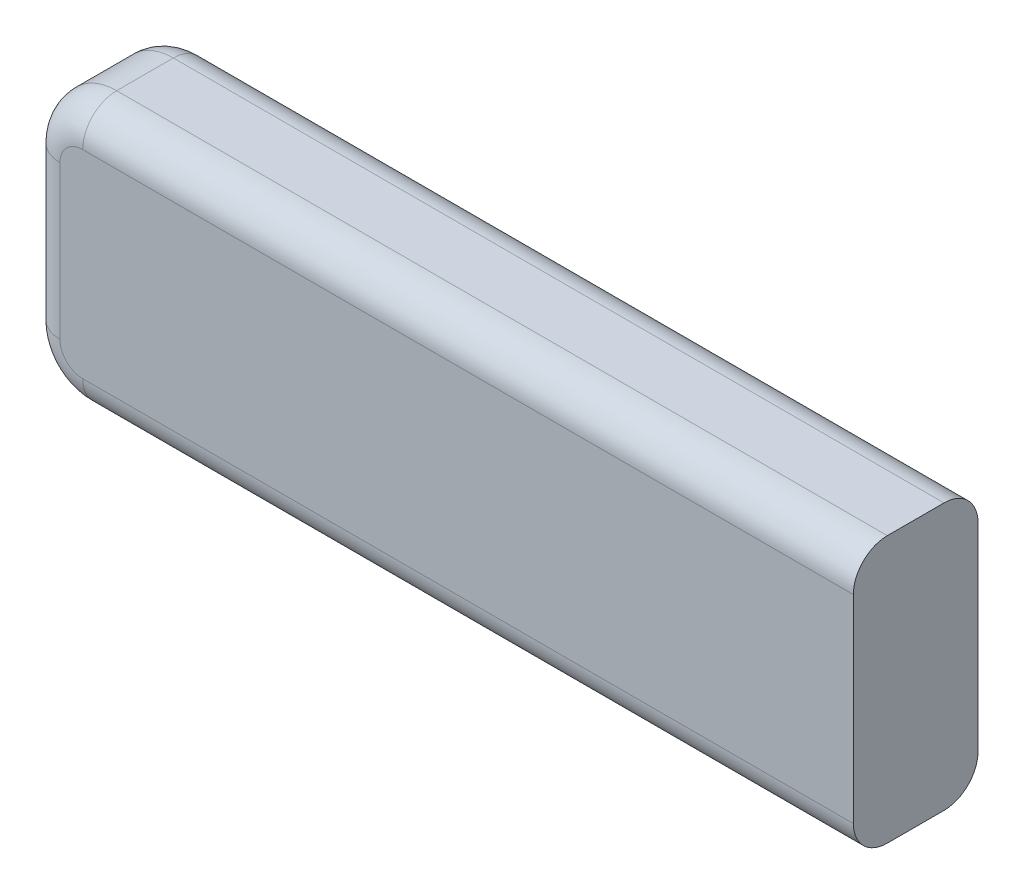
ISO-10303-21;
HEADER;
FILE_DESCRIPTION(('STEP AP214'),'2;1');
FILE_NAME('part.step','',(''),(''),'','','');
FILE_SCHEMA(('AUTOMOTIVE_DESIGN { 1 0 10303 214 1 1 1 1 }'));
ENDSEC;
DATA;
#1=APPLICATION_CONTEXT('core data for automotive mechanical design processes');
#2=APPLICATION_PROTOCOL_DEFINITION('international standard','automotive_design',2000,#1);
#3=PRODUCT_CONTEXT('',#1,'mechanical');
#4=PRODUCT('Part','Part','',(#3));
#5=PRODUCT_RELATED_PRODUCT_CATEGORY('part','',(#4));
#6=PRODUCT_DEFINITION_FORMATION('','',#4);
#7=PRODUCT_DEFINITION_CONTEXT('part definition',#1,'design');
#8=PRODUCT_DEFINITION('design','',#6,#7);
#9=PRODUCT_DEFINITION_SHAPE('','',#8);
#10=(LENGTH_UNIT() NAMED_UNIT(*) SI_UNIT(.MILLI.,.METRE.));
#11=(NAMED_UNIT(*) PLANE_ANGLE_UNIT() SI_UNIT($,.RADIAN.));
#12=(NAMED_UNIT(*) SI_UNIT($,.STERADIAN.) SOLID_ANGLE_UNIT());
#13=UNCERTAINTY_MEASURE_WITH_UNIT(LENGTH_MEASURE(1.E-05),#10,'distance_accuracy_value','');
#14=(GEOMETRIC_REPRESENTATION_CONTEXT(3) GLOBAL_UNCERTAINTY_ASSIGNED_CONTEXT((#13)) GLOBAL_UNIT_ASSIGNED_CONTEXT((#10,
#11,#12)) REPRESENTATION_CONTEXT('',''));
#15=CARTESIAN_POINT('',(0.,0.,0.));
#16=DIRECTION('',(0.,0.,1.));
#17=DIRECTION('',(1.,0.,0.));
#18=AXIS2_PLACEMENT_3D('',#15,#16,#17);
#19=CARTESIAN_POINT('',(0.,0.,5.5));
#20=DIRECTION('',(0.,0.,-1.));
#21=DIRECTION('',(-1.,0.,0.));
#22=AXIS2_PLACEMENT_3D('',#19,#20,#21);
#23=PLANE('',#22);
#24=CARTESIAN_POINT('',(2.5,2.5,5.5));
#25=DIRECTION('',(0.,0.,-1.));
#26=DIRECTION('',(-1.,0.,0.));
#27=AXIS2_PLACEMENT_3D('',#24,#25,#26);
#28=CIRCLE('',#27,1.);
#29=CARTESIAN_POINT('',(2.5,1.5,5.5));
#30=VERTEX_POINT('',#29);
#31=CARTESIAN_POINT('',(1.5,2.5,5.5));
#32=VERTEX_POINT('',#31);
#33=EDGE_CURVE('E200',#30,#32,#28,.T.);
#34=ORIENTED_EDGE('',*,*,#33,.F.);
#35=DIRECTION('',(1.,0.,0.));
#36=VECTOR('',#35,1.);
#37=CARTESIAN_POINT('',(0.,1.5,5.5));
#38=LINE('',#37,#36);
#39=CARTESIAN_POINT('',(36.5,1.5,5.5));
#40=VERTEX_POINT('',#39);
#41=EDGE_CURVE('E173',#30,#40,#38,.T.);
#42=ORIENTED_EDGE('',*,*,#41,.T.);
#43=DIRECTION('',(0.,1.,0.));
#44=VECTOR('',#43,1.);
#45=CARTESIAN_POINT('',(36.5,0.,5.5));
#46=LINE('',#45,#44);
#47=CARTESIAN_POINT('',(36.5,10.25,5.5));
#48=VERTEX_POINT('',#47);
#49=EDGE_CURVE('E137',#40,#48,#46,.T.);
#50=ORIENTED_EDGE('',*,*,#49,.T.);
#51=DIRECTION('',(-1.,0.,0.));
#52=VECTOR('',#51,1.);
#53=CARTESIAN_POINT('',(0.,10.25,5.5));
#54=LINE('',#53,#52);
#55=CARTESIAN_POINT('',(2.5,10.25,5.5));
#56=VERTEX_POINT('',#55);
#57=EDGE_CURVE('E167',#48,#56,#54,.T.);
#58=ORIENTED_EDGE('',*,*,#57,.T.);
#59=CARTESIAN_POINT('',(2.5,9.25,5.5));
#60=DIRECTION('',(0.,0.,-1.));
#61=DIRECTION('',(-1.,0.,0.));
#62=AXIS2_PLACEMENT_3D('',#59,#60,#61);
#63=CIRCLE('',#62,1.);
#64=CARTESIAN_POINT('',(1.5,9.25,5.5));
#65=VERTEX_POINT('',#64);
#66=EDGE_CURVE('E197',#65,#56,#63,.T.);
#67=ORIENTED_EDGE('',*,*,#66,.F.);
#68=DIRECTION('',(0.,-1.,0.));
#69=VECTOR('',#68,1.);
#70=CARTESIAN_POINT('',(1.5,0.,5.5));
#71=LINE('',#70,#69);
#72=EDGE_CURVE('E170',#65,#32,#71,.T.);
#73=ORIENTED_EDGE('',*,*,#72,.T.);
#74=EDGE_LOOP('',(#34,#42,#50,#58,#67,#73));
#75=FACE_BOUND('',#74,.T.);
#76=ADVANCED_FACE('F38',(#75),#23,.F.);
#77=CARTESIAN_POINT('',(0.,0.,0.));
#78=DIRECTION('',(0.,0.,-1.));
#79=DIRECTION('',(-1.,0.,0.));
#80=AXIS2_PLACEMENT_3D('',#77,#78,#79);
#81=PLANE('',#80);
#82=CARTESIAN_POINT('',(2.5,2.5,0.));
#83=DIRECTION('',(0.,0.,-1.));
#84=DIRECTION('',(-1.,0.,0.));
#85=AXIS2_PLACEMENT_3D('',#82,#83,#84);
#86=CIRCLE('',#85,1.);
#87=CARTESIAN_POINT('',(1.5,2.5,0.));
#88=VERTEX_POINT('',#87);
#89=CARTESIAN_POINT('',(2.5,1.5,0.));
#90=VERTEX_POINT('',#89);
#91=EDGE_CURVE('E188',#88,#90,#86,.F.);
#92=ORIENTED_EDGE('',*,*,#91,.F.);
#93=DIRECTION('',(0.,-1.,0.));
#94=VECTOR('',#93,1.);
#95=CARTESIAN_POINT('',(1.5,11.75,0.));
#96=LINE('',#95,#94);
#97=CARTESIAN_POINT('',(1.5,9.25,0.));
#98=VERTEX_POINT('',#97);
#99=EDGE_CURVE('E161',#88,#98,#96,.F.);
#100=ORIENTED_EDGE('',*,*,#99,.T.);
#101=CARTESIAN_POINT('',(2.5,9.25,0.));
#102=DIRECTION('',(0.,0.,-1.));
#103=DIRECTION('',(-1.,0.,0.));
#104=AXIS2_PLACEMENT_3D('',#101,#102,#103);
#105=CIRCLE('',#104,1.);
#106=CARTESIAN_POINT('',(2.5,10.25,0.));
#107=VERTEX_POINT('',#106);
#108=EDGE_CURVE('E185',#107,#98,#105,.F.);
#109=ORIENTED_EDGE('',*,*,#108,.F.);
#110=DIRECTION('',(-1.,0.,0.));
#111=VECTOR('',#110,1.);
#112=CARTESIAN_POINT('',(36.5,10.25,0.));
#113=LINE('',#112,#111);
#114=CARTESIAN_POINT('',(36.5,10.25,0.));
#115=VERTEX_POINT('',#114);
#116=EDGE_CURVE('E159',#107,#115,#113,.F.);
#117=ORIENTED_EDGE('',*,*,#116,.T.);
#118=DIRECTION('',(0.,1.,0.));
#119=VECTOR('',#118,1.);
#120=CARTESIAN_POINT('',(36.5,0.,0.));
#121=LINE('',#120,#119);
#122=CARTESIAN_POINT('',(36.5,1.5,0.));
#123=VERTEX_POINT('',#122);
#124=EDGE_CURVE('E221',#123,#115,#121,.T.);
#125=ORIENTED_EDGE('',*,*,#124,.F.);
#126=DIRECTION('',(1.,0.,0.));
#127=VECTOR('',#126,1.);
#128=CARTESIAN_POINT('',(0.,1.5,0.));
#129=LINE('',#128,#127);
#130=EDGE_CURVE('E164',#123,#90,#129,.F.);
#131=ORIENTED_EDGE('',*,*,#130,.T.);
#132=EDGE_LOOP('',(#92,#100,#109,#117,#125,#131));
#133=FACE_BOUND('',#132,.T.);
#134=ADVANCED_FACE('F266',(#133),#81,.T.);
#135=CARTESIAN_POINT('',(0.,0.,5.5));
#136=DIRECTION('',(1.,0.,0.));
#137=DIRECTION('',(0.,0.,-1.));
#138=AXIS2_PLACEMENT_3D('',#135,#136,#137);
#139=PLANE('',#138);
#140=DIRECTION('',(0.,-1.,0.));
#141=VECTOR('',#140,1.);
#142=CARTESIAN_POINT('',(0.,0.,4.));
#143=LINE('',#142,#141);
#144=CARTESIAN_POINT('',(0.,2.5,4.));
#145=VERTEX_POINT('',#144);
#146=CARTESIAN_POINT('',(0.,9.25,4.));
#147=VERTEX_POINT('',#146);
#148=EDGE_CURVE('E175',#145,#147,#143,.F.);
#149=ORIENTED_EDGE('',*,*,#148,.T.);
#150=DIRECTION('',(0.,0.,-1.));
#151=VECTOR('',#150,1.);
#152=CARTESIAN_POINT('',(0.,9.25,5.5));
#153=LINE('',#152,#151);
#154=CARTESIAN_POINT('',(0.,9.25,1.5));
#155=VERTEX_POINT('',#154);
#156=EDGE_CURVE('E213',#147,#155,#153,.T.);
#157=ORIENTED_EDGE('',*,*,#156,.T.);
#158=DIRECTION('',(0.,-1.,0.));
#159=VECTOR('',#158,1.);
#160=CARTESIAN_POINT('',(0.,0.,1.5));
#161=LINE('',#160,#159);
#162=CARTESIAN_POINT('',(0.,2.5,1.5));
#163=VERTEX_POINT('',#162);
#164=EDGE_CURVE('E178',#155,#163,#161,.T.);
#165=ORIENTED_EDGE('',*,*,#164,.T.);
#166=DIRECTION('',(0.,0.,-1.));
#167=VECTOR('',#166,1.);
#168=CARTESIAN_POINT('',(0.,2.5,5.5));
#169=LINE('',#168,#167);
#170=EDGE_CURVE('E211',#163,#145,#169,.F.);
#171=ORIENTED_EDGE('',*,*,#170,.T.);
#172=EDGE_LOOP('',(#149,#157,#165,#171));
#173=FACE_BOUND('',#172,.T.);
#174=ADVANCED_FACE('F271',(#173),#139,.F.);
#175=CARTESIAN_POINT('',(0.,0.,5.5));
#176=DIRECTION('',(0.,1.,0.));
#177=DIRECTION('',(0.,0.,1.));
#178=AXIS2_PLACEMENT_3D('',#175,#176,#177);
#179=PLANE('',#178);
#180=DIRECTION('',(1.,0.,0.));
#181=VECTOR('',#180,1.);
#182=CARTESIAN_POINT('',(0.,0.,4.));
#183=LINE('',#182,#181);
#184=CARTESIAN_POINT('',(36.5,0.,4.));
#185=VERTEX_POINT('',#184);
#186=CARTESIAN_POINT('',(2.5,0.,4.));
#187=VERTEX_POINT('',#186);
#188=EDGE_CURVE('E143',#185,#187,#183,.F.);
#189=ORIENTED_EDGE('',*,*,#188,.T.);
#190=DIRECTION('',(0.,0.,-1.));
#191=VECTOR('',#190,1.);
#192=CARTESIAN_POINT('',(2.5,0.,5.5));
#193=LINE('',#192,#191);
#194=CARTESIAN_POINT('',(2.5,0.,1.5));
#195=VERTEX_POINT('',#194);
#196=EDGE_CURVE('E11',#187,#195,#193,.T.);
#197=ORIENTED_EDGE('',*,*,#196,.T.);
#198=DIRECTION('',(1.,0.,0.));
#199=VECTOR('',#198,1.);
#200=CARTESIAN_POINT('',(36.5,0.,1.5));
#201=LINE('',#200,#199);
#202=CARTESIAN_POINT('',(36.5,0.,1.5));
#203=VERTEX_POINT('',#202);
#204=EDGE_CURVE('E146',#195,#203,#201,.T.);
#205=ORIENTED_EDGE('',*,*,#204,.T.);
#206=DIRECTION('',(0.,0.,-1.));
#207=VECTOR('',#206,1.);
#208=CARTESIAN_POINT('',(36.5,0.,5.5));
#209=LINE('',#208,#207);
#210=EDGE_CURVE('E135',#185,#203,#209,.T.);
#211=ORIENTED_EDGE('',*,*,#210,.F.);
#212=EDGE_LOOP('',(#189,#197,#205,#211));
#213=FACE_BOUND('',#212,.T.);
#214=ADVANCED_FACE('F142',(#213),#179,.F.);
#215=CARTESIAN_POINT('',(36.5,0.,5.5));
#216=DIRECTION('',(-1.,0.,0.));
#217=DIRECTION('',(0.,0.,1.));
#218=AXIS2_PLACEMENT_3D('',#215,#216,#217);
#219=PLANE('',#218);
#220=ORIENTED_EDGE('',*,*,#210,.T.);
#221=CARTESIAN_POINT('',(36.5,1.5,1.5));
#222=DIRECTION('',(-1.,0.,0.));
#223=DIRECTION('',(0.,0.,1.));
#224=AXIS2_PLACEMENT_3D('',#221,#222,#223);
#225=CIRCLE('',#224,1.5);
#226=EDGE_CURVE('E138',#203,#123,#225,.F.);
#227=ORIENTED_EDGE('',*,*,#226,.T.);
#228=ORIENTED_EDGE('',*,*,#124,.T.);
#229=CARTESIAN_POINT('',(36.5,10.25,1.5));
#230=DIRECTION('',(-1.,0.,0.));
#231=DIRECTION('',(0.,0.,1.));
#232=AXIS2_PLACEMENT_3D('',#229,#230,#231);
#233=CIRCLE('',#232,1.5);
#234=CARTESIAN_POINT('',(36.5,11.75,1.5));
#235=VERTEX_POINT('',#234);
#236=EDGE_CURVE('E139',#115,#235,#233,.F.);
#237=ORIENTED_EDGE('',*,*,#236,.T.);
#238=DIRECTION('',(0.,0.,-1.));
#239=VECTOR('',#238,1.);
#240=CARTESIAN_POINT('',(36.5,11.75,5.5));
#241=LINE('',#240,#239);
#242=CARTESIAN_POINT('',(36.5,11.75,4.));
#243=VERTEX_POINT('',#242);
#244=EDGE_CURVE('E148',#243,#235,#241,.T.);
#245=ORIENTED_EDGE('',*,*,#244,.F.);
#246=CARTESIAN_POINT('',(36.5,10.25,4.));
#247=DIRECTION('',(-1.,0.,0.));
#248=DIRECTION('',(0.,0.,1.));
#249=AXIS2_PLACEMENT_3D('',#246,#247,#248);
#250=CIRCLE('',#249,1.5);
#251=EDGE_CURVE('E152',#243,#48,#250,.F.);
#252=ORIENTED_EDGE('',*,*,#251,.T.);
#253=ORIENTED_EDGE('',*,*,#49,.F.);
#254=CARTESIAN_POINT('',(36.5,1.5,4.));
#255=DIRECTION('',(-1.,0.,0.));
#256=DIRECTION('',(0.,0.,1.));
#257=AXIS2_PLACEMENT_3D('',#254,#255,#256);
#258=CIRCLE('',#257,1.5);
#259=EDGE_CURVE('E132',#40,#185,#258,.F.);
#260=ORIENTED_EDGE('',*,*,#259,.T.);
#261=EDGE_LOOP('',(#220,#227,#228,#237,#245,#252,#253,#260));
#262=FACE_BOUND('',#261,.T.);
#263=ADVANCED_FACE('F134',(#262),#219,.F.);
#264=CARTESIAN_POINT('',(0.,11.75,5.5));
#265=DIRECTION('',(0.,-1.,0.));
#266=DIRECTION('',(0.,0.,-1.));
#267=AXIS2_PLACEMENT_3D('',#264,#265,#266);
#268=PLANE('',#267);
#269=DIRECTION('',(-1.,0.,0.));
#270=VECTOR('',#269,1.);
#271=CARTESIAN_POINT('',(0.,11.75,1.5));
#272=LINE('',#271,#270);
#273=CARTESIAN_POINT('',(2.5,11.75,1.5));
#274=VERTEX_POINT('',#273);
#275=EDGE_CURVE('E183',#235,#274,#272,.T.);
#276=ORIENTED_EDGE('',*,*,#275,.T.);
#277=DIRECTION('',(0.,0.,-1.));
#278=VECTOR('',#277,1.);
#279=CARTESIAN_POINT('',(2.5,11.75,5.5));
#280=LINE('',#279,#278);
#281=CARTESIAN_POINT('',(2.5,11.75,4.));
#282=VERTEX_POINT('',#281);
#283=EDGE_CURVE('E47',#274,#282,#280,.F.);
#284=ORIENTED_EDGE('',*,*,#283,.T.);
#285=DIRECTION('',(-1.,0.,0.));
#286=VECTOR('',#285,1.);
#287=CARTESIAN_POINT('',(0.,11.75,4.));
#288=LINE('',#287,#286);
#289=EDGE_CURVE('E181',#282,#243,#288,.F.);
#290=ORIENTED_EDGE('',*,*,#289,.T.);
#291=ORIENTED_EDGE('',*,*,#244,.T.);
#292=EDGE_LOOP('',(#276,#284,#290,#291));
#293=FACE_BOUND('',#292,.T.);
#294=ADVANCED_FACE('F254',(#293),#268,.F.);
#295=CARTESIAN_POINT('',(0.,10.25,1.5));
#296=DIRECTION('',(1.,0.,0.));
#297=DIRECTION('',(0.,0.,-1.));
#298=AXIS2_PLACEMENT_3D('',#295,#296,#297);
#299=CYLINDRICAL_SURFACE('',#298,1.5);
#300=ORIENTED_EDGE('',*,*,#116,.F.);
#301=CARTESIAN_POINT('',(2.5,10.25,1.5));
#302=DIRECTION('',(1.,0.,0.));
#303=DIRECTION('',(0.,0.,-1.));
#304=AXIS2_PLACEMENT_3D('',#301,#302,#303);
#305=CIRCLE('',#304,1.5);
#306=EDGE_CURVE('E63',#107,#274,#305,.T.);
#307=ORIENTED_EDGE('',*,*,#306,.T.);
#308=ORIENTED_EDGE('',*,*,#275,.F.);
#309=ORIENTED_EDGE('',*,*,#236,.F.);
#310=EDGE_LOOP('',(#300,#307,#308,#309));
#311=FACE_BOUND('',#310,.T.);
#312=ADVANCED_FACE('F252',(#311),#299,.T.);
#313=CARTESIAN_POINT('',(1.5,0.,1.5));
#314=DIRECTION('',(0.,1.,0.));
#315=DIRECTION('',(0.,0.,1.));
#316=AXIS2_PLACEMENT_3D('',#313,#314,#315);
#317=CYLINDRICAL_SURFACE('',#316,1.5);
#318=ORIENTED_EDGE('',*,*,#164,.F.);
#319=CARTESIAN_POINT('',(1.5,9.25,1.5));
#320=DIRECTION('',(0.,-1.,0.));
#321=DIRECTION('',(0.,0.,-1.));
#322=AXIS2_PLACEMENT_3D('',#319,#320,#321);
#323=CIRCLE('',#322,1.5);
#324=EDGE_CURVE('E205',#155,#98,#323,.T.);
#325=ORIENTED_EDGE('',*,*,#324,.T.);
#326=ORIENTED_EDGE('',*,*,#99,.F.);
#327=CARTESIAN_POINT('',(1.5,2.5,1.5));
#328=DIRECTION('',(0.,1.,0.));
#329=DIRECTION('',(0.,0.,1.));
#330=AXIS2_PLACEMENT_3D('',#327,#328,#329);
#331=CIRCLE('',#330,1.5);
#332=EDGE_CURVE('E203',#88,#163,#331,.T.);
#333=ORIENTED_EDGE('',*,*,#332,.T.);
#334=EDGE_LOOP('',(#318,#325,#326,#333));
#335=FACE_BOUND('',#334,.T.);
#336=ADVANCED_FACE('F261',(#335),#317,.T.);
#337=CARTESIAN_POINT('',(0.,1.5,1.5));
#338=DIRECTION('',(-1.,0.,0.));
#339=DIRECTION('',(0.,0.,1.));
#340=AXIS2_PLACEMENT_3D('',#337,#338,#339);
#341=CYLINDRICAL_SURFACE('',#340,1.5);
#342=ORIENTED_EDGE('',*,*,#204,.F.);
#343=CARTESIAN_POINT('',(2.5,1.5,1.5));
#344=DIRECTION('',(1.,0.,0.));
#345=DIRECTION('',(0.,0.,-1.));
#346=AXIS2_PLACEMENT_3D('',#343,#344,#345);
#347=CIRCLE('',#346,1.5);
#348=EDGE_CURVE('E191',#195,#90,#347,.T.);
#349=ORIENTED_EDGE('',*,*,#348,.T.);
#350=ORIENTED_EDGE('',*,*,#130,.F.);
#351=ORIENTED_EDGE('',*,*,#226,.F.);
#352=EDGE_LOOP('',(#342,#349,#350,#351));
#353=FACE_BOUND('',#352,.T.);
#354=ADVANCED_FACE('F305',(#353),#341,.T.);
#355=CARTESIAN_POINT('',(0.,10.25,4.));
#356=DIRECTION('',(-1.,0.,0.));
#357=DIRECTION('',(0.,0.,1.));
#358=AXIS2_PLACEMENT_3D('',#355,#356,#357);
#359=CYLINDRICAL_SURFACE('',#358,1.5);
#360=ORIENTED_EDGE('',*,*,#289,.F.);
#361=CARTESIAN_POINT('',(2.5,10.25,4.));
#362=DIRECTION('',(1.,0.,0.));
#363=DIRECTION('',(0.,0.,-1.));
#364=AXIS2_PLACEMENT_3D('',#361,#362,#363);
#365=CIRCLE('',#364,1.5);
#366=EDGE_CURVE('E207',#282,#56,#365,.T.);
#367=ORIENTED_EDGE('',*,*,#366,.T.);
#368=ORIENTED_EDGE('',*,*,#57,.F.);
#369=ORIENTED_EDGE('',*,*,#251,.F.);
#370=EDGE_LOOP('',(#360,#367,#368,#369));
#371=FACE_BOUND('',#370,.T.);
#372=ADVANCED_FACE('F239',(#371),#359,.T.);
#373=CARTESIAN_POINT('',(1.5,0.,4.));
#374=DIRECTION('',(0.,-1.,0.));
#375=DIRECTION('',(0.,0.,-1.));
#376=AXIS2_PLACEMENT_3D('',#373,#374,#375);
#377=CYLINDRICAL_SURFACE('',#376,1.5);
#378=ORIENTED_EDGE('',*,*,#148,.F.);
#379=CARTESIAN_POINT('',(1.5,2.5,4.));
#380=DIRECTION('',(0.,1.,0.));
#381=DIRECTION('',(0.,0.,1.));
#382=AXIS2_PLACEMENT_3D('',#379,#380,#381);
#383=CIRCLE('',#382,1.5);
#384=EDGE_CURVE('E195',#145,#32,#383,.T.);
#385=ORIENTED_EDGE('',*,*,#384,.T.);
#386=ORIENTED_EDGE('',*,*,#72,.F.);
#387=CARTESIAN_POINT('',(1.5,9.25,4.));
#388=DIRECTION('',(0.,-1.,0.));
#389=DIRECTION('',(0.,0.,-1.));
#390=AXIS2_PLACEMENT_3D('',#387,#388,#389);
#391=CIRCLE('',#390,1.5);
#392=EDGE_CURVE('E193',#65,#147,#391,.T.);
#393=ORIENTED_EDGE('',*,*,#392,.T.);
#394=EDGE_LOOP('',(#378,#385,#386,#393));
#395=FACE_BOUND('',#394,.T.);
#396=ADVANCED_FACE('F304',(#395),#377,.T.);
#397=CARTESIAN_POINT('',(0.,1.5,4.));
#398=DIRECTION('',(1.,0.,0.));
#399=DIRECTION('',(0.,0.,-1.));
#400=AXIS2_PLACEMENT_3D('',#397,#398,#399);
#401=CYLINDRICAL_SURFACE('',#400,1.5);
#402=ORIENTED_EDGE('',*,*,#41,.F.);
#403=CARTESIAN_POINT('',(2.5,1.5,4.));
#404=DIRECTION('',(1.,0.,0.));
#405=DIRECTION('',(0.,0.,-1.));
#406=AXIS2_PLACEMENT_3D('',#403,#404,#405);
#407=CIRCLE('',#406,1.5);
#408=EDGE_CURVE('E55',#30,#187,#407,.T.);
#409=ORIENTED_EDGE('',*,*,#408,.T.);
#410=ORIENTED_EDGE('',*,*,#188,.F.);
#411=ORIENTED_EDGE('',*,*,#259,.F.);
#412=EDGE_LOOP('',(#402,#409,#410,#411));
#413=FACE_BOUND('',#412,.T.);
#414=ADVANCED_FACE('F150',(#413),#401,.T.);
#415=CARTESIAN_POINT('',(2.5,2.5,4.));
#416=DIRECTION('',(0.,0.,-1.));
#417=DIRECTION('',(-1.,0.,0.));
#418=AXIS2_PLACEMENT_3D('',#415,#416,#417);
#419=DEGENERATE_TOROIDAL_SURFACE('',#418,1.,1.5,.T.);
#420=ORIENTED_EDGE('',*,*,#33,.T.);
#421=ORIENTED_EDGE('',*,*,#384,.F.);
#422=CARTESIAN_POINT('',(2.5,2.5,4.));
#423=DIRECTION('',(0.,0.,-1.));
#424=DIRECTION('',(-1.,0.,0.));
#425=AXIS2_PLACEMENT_3D('',#422,#423,#424);
#426=CIRCLE('',#425,2.5);
#427=EDGE_CURVE('E219',#187,#145,#426,.T.);
#428=ORIENTED_EDGE('',*,*,#427,.F.);
#429=ORIENTED_EDGE('',*,*,#408,.F.);
#430=EDGE_LOOP('',(#420,#421,#428,#429));
#431=FACE_BOUND('',#430,.T.);
#432=ADVANCED_FACE('F291',(#431),#419,.T.);
#433=CARTESIAN_POINT('',(2.5,2.5,5.5));
#434=DIRECTION('',(0.,0.,-1.));
#435=DIRECTION('',(-1.,0.,0.));
#436=AXIS2_PLACEMENT_3D('',#433,#434,#435);
#437=CYLINDRICAL_SURFACE('',#436,2.5);
#438=ORIENTED_EDGE('',*,*,#427,.T.);
#439=ORIENTED_EDGE('',*,*,#170,.F.);
#440=CARTESIAN_POINT('',(2.5,2.5,1.5));
#441=DIRECTION('',(0.,0.,-1.));
#442=DIRECTION('',(-1.,0.,0.));
#443=AXIS2_PLACEMENT_3D('',#440,#441,#442);
#444=CIRCLE('',#443,2.5);
#445=EDGE_CURVE('E216',#195,#163,#444,.T.);
#446=ORIENTED_EDGE('',*,*,#445,.F.);
#447=ORIENTED_EDGE('',*,*,#196,.F.);
#448=EDGE_LOOP('',(#438,#439,#446,#447));
#449=FACE_BOUND('',#448,.T.);
#450=ADVANCED_FACE('F294',(#449),#437,.T.);
#451=CARTESIAN_POINT('',(2.5,2.5,1.5));
#452=DIRECTION('',(0.,0.,-1.));
#453=DIRECTION('',(-1.,0.,0.));
#454=AXIS2_PLACEMENT_3D('',#451,#452,#453);
#455=DEGENERATE_TOROIDAL_SURFACE('',#454,1.,1.5,.T.);
#456=ORIENTED_EDGE('',*,*,#332,.F.);
#457=ORIENTED_EDGE('',*,*,#91,.T.);
#458=ORIENTED_EDGE('',*,*,#348,.F.);
#459=ORIENTED_EDGE('',*,*,#445,.T.);
#460=EDGE_LOOP('',(#456,#457,#458,#459));
#461=FACE_BOUND('',#460,.T.);
#462=ADVANCED_FACE('F298',(#461),#455,.T.);
#463=CARTESIAN_POINT('',(2.5,9.25,4.));
#464=DIRECTION('',(0.,0.,-1.));
#465=DIRECTION('',(-1.,0.,0.));
#466=AXIS2_PLACEMENT_3D('',#463,#464,#465);
#467=DEGENERATE_TOROIDAL_SURFACE('',#466,1.,1.5,.T.);
#468=ORIENTED_EDGE('',*,*,#66,.T.);
#469=ORIENTED_EDGE('',*,*,#366,.F.);
#470=CARTESIAN_POINT('',(2.5,9.25,4.));
#471=DIRECTION('',(0.,0.,-1.));
#472=DIRECTION('',(-1.,0.,0.));
#473=AXIS2_PLACEMENT_3D('',#470,#471,#472);
#474=CIRCLE('',#473,2.5);
#475=EDGE_CURVE('E42',#147,#282,#474,.T.);
#476=ORIENTED_EDGE('',*,*,#475,.F.);
#477=ORIENTED_EDGE('',*,*,#392,.F.);
#478=EDGE_LOOP('',(#468,#469,#476,#477));
#479=FACE_BOUND('',#478,.T.);
#480=ADVANCED_FACE('F40',(#479),#467,.T.);
#481=CARTESIAN_POINT('',(2.5,9.25,5.5));
#482=DIRECTION('',(0.,0.,-1.));
#483=DIRECTION('',(-1.,0.,0.));
#484=AXIS2_PLACEMENT_3D('',#481,#482,#483);
#485=CYLINDRICAL_SURFACE('',#484,2.5);
#486=ORIENTED_EDGE('',*,*,#475,.T.);
#487=ORIENTED_EDGE('',*,*,#283,.F.);
#488=CARTESIAN_POINT('',(2.5,9.25,1.5));
#489=DIRECTION('',(0.,0.,-1.));
#490=DIRECTION('',(-1.,0.,0.));
#491=AXIS2_PLACEMENT_3D('',#488,#489,#490);
#492=CIRCLE('',#491,2.5);
#493=EDGE_CURVE('E222',#155,#274,#492,.T.);
#494=ORIENTED_EDGE('',*,*,#493,.F.);
#495=ORIENTED_EDGE('',*,*,#156,.F.);
#496=EDGE_LOOP('',(#486,#487,#494,#495));
#497=FACE_BOUND('',#496,.T.);
#498=ADVANCED_FACE('F232',(#497),#485,.T.);
#499=CARTESIAN_POINT('',(2.5,9.25,1.5));
#500=DIRECTION('',(0.,0.,-1.));
#501=DIRECTION('',(-1.,0.,0.));
#502=AXIS2_PLACEMENT_3D('',#499,#500,#501);
#503=DEGENERATE_TOROIDAL_SURFACE('',#502,1.,1.5,.T.);
#504=ORIENTED_EDGE('',*,*,#306,.F.);
#505=ORIENTED_EDGE('',*,*,#108,.T.);
#506=ORIENTED_EDGE('',*,*,#324,.F.);
#507=ORIENTED_EDGE('',*,*,#493,.T.);
#508=EDGE_LOOP('',(#504,#505,#506,#507));
#509=FACE_BOUND('',#508,.T.);
#510=ADVANCED_FACE('F284',(#509),#503,.T.);
#511=CLOSED_SHELL('',(#76,#134,#174,#214,#263,#294,#312,#336,#354,#372,#396,#414,#432,#450,#462,
#480,#498,#510));
#512=MANIFOLD_SOLID_BREP('B2',#511);
#513=ADVANCED_BREP_SHAPE_REPRESENTATION('',(#18,#512),#14);
#514=SHAPE_DEFINITION_REPRESENTATION(#9,#513);
ENDSEC;
END-ISO-10303-21;
